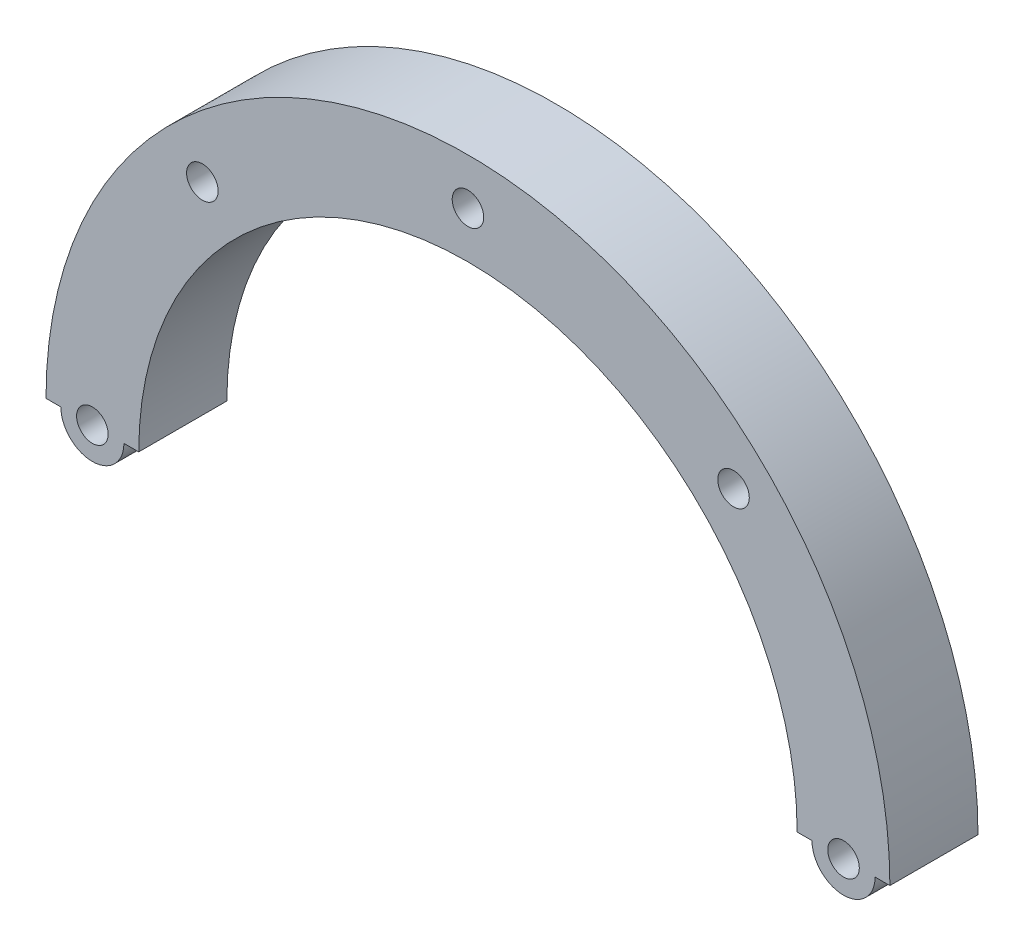
ISO-10303-21;
HEADER;
FILE_DESCRIPTION(('STEP AP214'),'2;1');
FILE_NAME('part.step','',(''),(''),'','','');
FILE_SCHEMA(('AUTOMOTIVE_DESIGN { 1 0 10303 214 1 1 1 1 }'));
ENDSEC;
DATA;
#1=APPLICATION_CONTEXT('core data for automotive mechanical design processes');
#2=APPLICATION_PROTOCOL_DEFINITION('international standard','automotive_design',2000,#1);
#3=PRODUCT_CONTEXT('',#1,'mechanical');
#4=PRODUCT('Part','Part','',(#3));
#5=PRODUCT_RELATED_PRODUCT_CATEGORY('part','',(#4));
#6=PRODUCT_DEFINITION_FORMATION('','',#4);
#7=PRODUCT_DEFINITION_CONTEXT('part definition',#1,'design');
#8=PRODUCT_DEFINITION('design','',#6,#7);
#9=PRODUCT_DEFINITION_SHAPE('','',#8);
#10=(LENGTH_UNIT() NAMED_UNIT(*) SI_UNIT(.MILLI.,.METRE.));
#11=(NAMED_UNIT(*) PLANE_ANGLE_UNIT() SI_UNIT($,.RADIAN.));
#12=(NAMED_UNIT(*) SI_UNIT($,.STERADIAN.) SOLID_ANGLE_UNIT());
#13=UNCERTAINTY_MEASURE_WITH_UNIT(LENGTH_MEASURE(1.E-05),#10,'distance_accuracy_value','');
#14=(GEOMETRIC_REPRESENTATION_CONTEXT(3) GLOBAL_UNCERTAINTY_ASSIGNED_CONTEXT((#13)) GLOBAL_UNIT_ASSIGNED_CONTEXT((#10,
#11,#12)) REPRESENTATION_CONTEXT('',''));
#15=CARTESIAN_POINT('',(0.,0.,0.));
#16=DIRECTION('',(0.,0.,1.));
#17=DIRECTION('',(1.,0.,0.));
#18=AXIS2_PLACEMENT_3D('',#15,#16,#17);
#19=CARTESIAN_POINT('',(-45.5,0.,9.5));
#20=DIRECTION('',(0.,1.,0.));
#21=DIRECTION('',(0.,0.,1.));
#22=AXIS2_PLACEMENT_3D('',#19,#20,#21);
#23=PLANE('',#22);
#24=DIRECTION('',(1.,0.,0.));
#25=VECTOR('',#24,1.);
#26=CARTESIAN_POINT('',(-45.5,0.,0.));
#27=LINE('',#26,#25);
#28=CARTESIAN_POINT('',(-45.5,0.,0.));
#29=VERTEX_POINT('',#28);
#30=CARTESIAN_POINT('',(-43.9000000000029,0.,0.));
#31=VERTEX_POINT('',#30);
#32=EDGE_CURVE('E174',#29,#31,#27,.T.);
#33=ORIENTED_EDGE('',*,*,#32,.T.);
#34=DIRECTION('',(0.,0.,1.));
#35=VECTOR('',#34,1.);
#36=CARTESIAN_POINT('',(-43.9000000000029,0.,-9.61665222413705));
#37=LINE('',#36,#35);
#38=CARTESIAN_POINT('',(-43.9000000000029,0.,9.5));
#39=VERTEX_POINT('',#38);
#40=EDGE_CURVE('E131',#31,#39,#37,.T.);
#41=ORIENTED_EDGE('',*,*,#40,.T.);
#42=DIRECTION('',(1.,0.,0.));
#43=VECTOR('',#42,1.);
#44=CARTESIAN_POINT('',(-45.5,0.,9.5));
#45=LINE('',#44,#43);
#46=CARTESIAN_POINT('',(-45.5,0.,9.5));
#47=VERTEX_POINT('',#46);
#48=EDGE_CURVE('E164',#47,#39,#45,.T.);
#49=ORIENTED_EDGE('',*,*,#48,.F.);
#50=DIRECTION('',(0.,0.,-1.));
#51=VECTOR('',#50,1.);
#52=CARTESIAN_POINT('',(-45.5,0.,9.5));
#53=LINE('',#52,#51);
#54=EDGE_CURVE('E40',#47,#29,#53,.T.);
#55=ORIENTED_EDGE('',*,*,#54,.T.);
#56=EDGE_LOOP('',(#33,#41,#49,#55));
#57=FACE_BOUND('',#56,.T.);
#58=ADVANCED_FACE('F32',(#57),#23,.F.);
#59=CARTESIAN_POINT('',(35.5,0.,9.5));
#60=DIRECTION('',(0.,1.,0.));
#61=DIRECTION('',(0.,0.,1.));
#62=AXIS2_PLACEMENT_3D('',#59,#60,#61);
#63=PLANE('',#62);
#64=DIRECTION('',(1.,0.,0.));
#65=VECTOR('',#64,1.);
#66=CARTESIAN_POINT('',(35.5,0.,0.));
#67=LINE('',#66,#65);
#68=CARTESIAN_POINT('',(35.5,0.,0.));
#69=VERTEX_POINT('',#68);
#70=CARTESIAN_POINT('',(37.1000000000029,0.,0.));
#71=VERTEX_POINT('',#70);
#72=EDGE_CURVE('E107',#69,#71,#67,.T.);
#73=ORIENTED_EDGE('',*,*,#72,.T.);
#74=DIRECTION('',(0.,0.,1.));
#75=VECTOR('',#74,1.);
#76=CARTESIAN_POINT('',(37.1000000000029,0.,-9.61665222413705));
#77=LINE('',#76,#75);
#78=CARTESIAN_POINT('',(37.1000000000029,0.,9.5));
#79=VERTEX_POINT('',#78);
#80=EDGE_CURVE('E55',#71,#79,#77,.T.);
#81=ORIENTED_EDGE('',*,*,#80,.T.);
#82=DIRECTION('',(1.,0.,0.));
#83=VECTOR('',#82,1.);
#84=CARTESIAN_POINT('',(35.5,0.,9.5));
#85=LINE('',#84,#83);
#86=CARTESIAN_POINT('',(35.5,0.,9.5));
#87=VERTEX_POINT('',#86);
#88=EDGE_CURVE('E169',#87,#79,#85,.T.);
#89=ORIENTED_EDGE('',*,*,#88,.F.);
#90=DIRECTION('',(0.,0.,-1.));
#91=VECTOR('',#90,1.);
#92=CARTESIAN_POINT('',(35.5,0.,9.5));
#93=LINE('',#92,#91);
#94=EDGE_CURVE('E178',#87,#69,#93,.T.);
#95=ORIENTED_EDGE('',*,*,#94,.T.);
#96=EDGE_LOOP('',(#73,#81,#89,#95));
#97=FACE_BOUND('',#96,.T.);
#98=ADVANCED_FACE('F195',(#97),#63,.F.);
#99=CARTESIAN_POINT('',(0.,0.,9.5));
#100=DIRECTION('',(0.,0.,-1.));
#101=DIRECTION('',(-1.,0.,0.));
#102=AXIS2_PLACEMENT_3D('',#99,#100,#101);
#103=CYLINDRICAL_SURFACE('',#102,45.5);
#104=CARTESIAN_POINT('',(0.,0.,0.));
#105=DIRECTION('',(0.,0.,1.));
#106=DIRECTION('',(1.,0.,0.));
#107=AXIS2_PLACEMENT_3D('',#104,#105,#106);
#108=CIRCLE('',#107,45.5);
#109=CARTESIAN_POINT('',(45.5,0.,0.));
#110=VERTEX_POINT('',#109);
#111=EDGE_CURVE('E105',#110,#29,#108,.T.);
#112=ORIENTED_EDGE('',*,*,#111,.T.);
#113=ORIENTED_EDGE('',*,*,#54,.F.);
#114=CARTESIAN_POINT('',(0.,0.,9.5));
#115=DIRECTION('',(0.,0.,1.));
#116=DIRECTION('',(1.,0.,0.));
#117=AXIS2_PLACEMENT_3D('',#114,#115,#116);
#118=CIRCLE('',#117,45.5);
#119=CARTESIAN_POINT('',(45.5,0.,9.5));
#120=VERTEX_POINT('',#119);
#121=EDGE_CURVE('E160',#120,#47,#118,.T.);
#122=ORIENTED_EDGE('',*,*,#121,.F.);
#123=DIRECTION('',(0.,0.,-1.));
#124=VECTOR('',#123,1.);
#125=CARTESIAN_POINT('',(45.5,0.,9.5));
#126=LINE('',#125,#124);
#127=EDGE_CURVE('E171',#120,#110,#126,.T.);
#128=ORIENTED_EDGE('',*,*,#127,.T.);
#129=EDGE_LOOP('',(#112,#113,#122,#128));
#130=FACE_BOUND('',#129,.T.);
#131=ADVANCED_FACE('F34',(#130),#103,.T.);
#132=CARTESIAN_POINT('',(-37.1000000000029,0.,9.5));
#133=VERTEX_POINT('',#132);
#134=CARTESIAN_POINT('',(-35.5,0.,9.5));
#135=VERTEX_POINT('',#134);
#136=EDGE_CURVE('E163',#133,#135,#45,.T.);
#137=ORIENTED_EDGE('',*,*,#136,.F.);
#138=DIRECTION('',(0.,0.,1.));
#139=VECTOR('',#138,1.);
#140=CARTESIAN_POINT('',(-37.1000000000029,0.,-9.61665222413705));
#141=LINE('',#140,#139);
#142=CARTESIAN_POINT('',(-37.1000000000029,0.,0.));
#143=VERTEX_POINT('',#142);
#144=EDGE_CURVE('E126',#133,#143,#141,.F.);
#145=ORIENTED_EDGE('',*,*,#144,.T.);
#146=CARTESIAN_POINT('',(-35.5,0.,0.));
#147=VERTEX_POINT('',#146);
#148=EDGE_CURVE('E173',#143,#147,#27,.T.);
#149=ORIENTED_EDGE('',*,*,#148,.T.);
#150=DIRECTION('',(0.,0.,-1.));
#151=VECTOR('',#150,1.);
#152=CARTESIAN_POINT('',(-35.5,0.,9.5));
#153=LINE('',#152,#151);
#154=EDGE_CURVE('E181',#135,#147,#153,.T.);
#155=ORIENTED_EDGE('',*,*,#154,.F.);
#156=EDGE_LOOP('',(#137,#145,#149,#155));
#157=FACE_BOUND('',#156,.T.);
#158=ADVANCED_FACE('F201',(#157),#23,.F.);
#159=CARTESIAN_POINT('',(0.,0.,9.5));
#160=DIRECTION('',(0.,0.,-1.));
#161=DIRECTION('',(-1.,0.,0.));
#162=AXIS2_PLACEMENT_3D('',#159,#160,#161);
#163=CYLINDRICAL_SURFACE('',#162,35.5);
#164=CARTESIAN_POINT('',(0.,0.,0.));
#165=DIRECTION('',(0.,0.,-1.));
#166=DIRECTION('',(1.,0.,0.));
#167=AXIS2_PLACEMENT_3D('',#164,#165,#166);
#168=CIRCLE('',#167,35.5);
#169=EDGE_CURVE('E108',#147,#69,#168,.T.);
#170=ORIENTED_EDGE('',*,*,#169,.T.);
#171=ORIENTED_EDGE('',*,*,#94,.F.);
#172=CARTESIAN_POINT('',(0.,0.,9.5));
#173=DIRECTION('',(0.,0.,-1.));
#174=DIRECTION('',(1.,0.,0.));
#175=AXIS2_PLACEMENT_3D('',#172,#173,#174);
#176=CIRCLE('',#175,35.5);
#177=EDGE_CURVE('E167',#135,#87,#176,.T.);
#178=ORIENTED_EDGE('',*,*,#177,.F.);
#179=ORIENTED_EDGE('',*,*,#154,.T.);
#180=EDGE_LOOP('',(#170,#171,#178,#179));
#181=FACE_BOUND('',#180,.T.);
#182=ADVANCED_FACE('F198',(#181),#163,.F.);
#183=CARTESIAN_POINT('',(43.9000000000029,0.,9.5));
#184=VERTEX_POINT('',#183);
#185=EDGE_CURVE('E47',#184,#120,#85,.T.);
#186=ORIENTED_EDGE('',*,*,#185,.F.);
#187=DIRECTION('',(0.,0.,1.));
#188=VECTOR('',#187,1.);
#189=CARTESIAN_POINT('',(43.9000000000029,0.,-9.61665222413705));
#190=LINE('',#189,#188);
#191=CARTESIAN_POINT('',(43.9000000000029,0.,0.));
#192=VERTEX_POINT('',#191);
#193=EDGE_CURVE('E110',#184,#192,#190,.F.);
#194=ORIENTED_EDGE('',*,*,#193,.T.);
#195=EDGE_CURVE('E99',#192,#110,#67,.T.);
#196=ORIENTED_EDGE('',*,*,#195,.T.);
#197=ORIENTED_EDGE('',*,*,#127,.F.);
#198=EDGE_LOOP('',(#186,#194,#196,#197));
#199=FACE_BOUND('',#198,.T.);
#200=ADVANCED_FACE('F111',(#199),#63,.F.);
#201=CARTESIAN_POINT('',(0.,0.,9.5));
#202=DIRECTION('',(0.,0.,1.));
#203=DIRECTION('',(1.,0.,0.));
#204=AXIS2_PLACEMENT_3D('',#201,#202,#203);
#205=PLANE('',#204);
#206=ORIENTED_EDGE('',*,*,#88,.T.);
#207=CARTESIAN_POINT('',(40.5000000000029,1.05619134740018E-12,9.5));
#208=DIRECTION('',(0.,0.,1.));
#209=DIRECTION('',(-1.,0.,0.));
#210=AXIS2_PLACEMENT_3D('',#207,#208,#209);
#211=CIRCLE('',#210,3.4);
#212=EDGE_CURVE('E117',#79,#184,#211,.T.);
#213=ORIENTED_EDGE('',*,*,#212,.T.);
#214=ORIENTED_EDGE('',*,*,#185,.T.);
#215=ORIENTED_EDGE('',*,*,#121,.T.);
#216=ORIENTED_EDGE('',*,*,#48,.T.);
#217=CARTESIAN_POINT('',(-40.5000000000029,1.05619134740018E-12,9.5));
#218=DIRECTION('',(0.,0.,1.));
#219=DIRECTION('',(1.,0.,0.));
#220=AXIS2_PLACEMENT_3D('',#217,#218,#219);
#221=CIRCLE('',#220,3.4);
#222=EDGE_CURVE('E122',#39,#133,#221,.T.);
#223=ORIENTED_EDGE('',*,*,#222,.T.);
#224=ORIENTED_EDGE('',*,*,#136,.T.);
#225=ORIENTED_EDGE('',*,*,#177,.T.);
#226=EDGE_LOOP('',(#206,#213,#214,#215,#216,#223,#224,#225));
#227=FACE_BOUND('',#226,.T.);
#228=CARTESIAN_POINT('',(40.5000000000029,1.05619134740018E-12,9.5));
#229=DIRECTION('',(0.,0.,1.));
#230=DIRECTION('',(1.,0.,0.));
#231=AXIS2_PLACEMENT_3D('',#228,#229,#230);
#232=CIRCLE('',#231,1.70000000000031);
#233=CARTESIAN_POINT('',(42.2000000000032,1.05619134740018E-12,9.5));
#234=VERTEX_POINT('',#233);
#235=EDGE_CURVE('E145',#234,#234,#232,.T.);
#236=ORIENTED_EDGE('',*,*,#235,.F.);
#237=EDGE_LOOP('',(#236));
#238=FACE_BOUND('',#237,.T.);
#239=CARTESIAN_POINT('',(-40.5000000000029,1.05619134740018E-12,9.5));
#240=DIRECTION('',(0.,0.,1.));
#241=DIRECTION('',(-1.,0.,0.));
#242=AXIS2_PLACEMENT_3D('',#239,#240,#241);
#243=CIRCLE('',#242,1.70000000000031);
#244=CARTESIAN_POINT('',(-42.2000000000032,1.05619134740018E-12,9.5));
#245=VERTEX_POINT('',#244);
#246=EDGE_CURVE('E140',#245,#245,#243,.T.);
#247=ORIENTED_EDGE('',*,*,#246,.F.);
#248=EDGE_LOOP('',(#247));
#249=FACE_BOUND('',#248,.T.);
#250=CARTESIAN_POINT('',(0.,40.5,9.5));
#251=DIRECTION('',(0.,0.,1.));
#252=DIRECTION('',(1.,0.,0.));
#253=AXIS2_PLACEMENT_3D('',#250,#251,#252);
#254=CIRCLE('',#253,1.7);
#255=CARTESIAN_POINT('',(1.7,40.5,9.5));
#256=VERTEX_POINT('',#255);
#257=EDGE_CURVE('E137',#256,#256,#254,.T.);
#258=ORIENTED_EDGE('',*,*,#257,.F.);
#259=EDGE_LOOP('',(#258));
#260=FACE_BOUND('',#259,.T.);
#261=CARTESIAN_POINT('',(-28.6378246380567,28.6378246380566,9.5));
#262=DIRECTION('',(0.,0.,1.));
#263=DIRECTION('',(-1.,0.,0.));
#264=AXIS2_PLACEMENT_3D('',#261,#262,#263);
#265=CIRCLE('',#264,1.69999999999942);
#266=CARTESIAN_POINT('',(-30.3378246380561,28.6378246380566,9.5));
#267=VERTEX_POINT('',#266);
#268=EDGE_CURVE('E133',#267,#267,#265,.T.);
#269=ORIENTED_EDGE('',*,*,#268,.F.);
#270=EDGE_LOOP('',(#269));
#271=FACE_BOUND('',#270,.T.);
#272=CARTESIAN_POINT('',(28.6378246380567,28.6378246380566,9.5));
#273=DIRECTION('',(0.,0.,1.));
#274=DIRECTION('',(1.,0.,0.));
#275=AXIS2_PLACEMENT_3D('',#272,#273,#274);
#276=CIRCLE('',#275,1.69999999999942);
#277=CARTESIAN_POINT('',(30.3378246380561,28.6378246380566,9.5));
#278=VERTEX_POINT('',#277);
#279=EDGE_CURVE('E144',#278,#278,#276,.T.);
#280=ORIENTED_EDGE('',*,*,#279,.F.);
#281=EDGE_LOOP('',(#280));
#282=FACE_BOUND('',#281,.T.);
#283=ADVANCED_FACE('F190',(#227,#238,#249,#260,#271,#282),#205,.T.);
#284=CARTESIAN_POINT('',(0.,0.,0.));
#285=DIRECTION('',(0.,0.,1.));
#286=DIRECTION('',(1.,0.,0.));
#287=AXIS2_PLACEMENT_3D('',#284,#285,#286);
#288=PLANE('',#287);
#289=CARTESIAN_POINT('',(40.5000000000029,1.05619134740018E-12,0.));
#290=DIRECTION('',(0.,0.,1.));
#291=DIRECTION('',(1.,0.,0.));
#292=AXIS2_PLACEMENT_3D('',#289,#290,#291);
#293=CIRCLE('',#292,1.70000000000031);
#294=CARTESIAN_POINT('',(42.2000000000032,1.05619134740018E-12,0.));
#295=VERTEX_POINT('',#294);
#296=EDGE_CURVE('E141',#295,#295,#293,.T.);
#297=ORIENTED_EDGE('',*,*,#296,.T.);
#298=EDGE_LOOP('',(#297));
#299=FACE_BOUND('',#298,.T.);
#300=CARTESIAN_POINT('',(-40.5000000000029,1.05619134740018E-12,0.));
#301=DIRECTION('',(0.,0.,1.));
#302=DIRECTION('',(1.,0.,0.));
#303=AXIS2_PLACEMENT_3D('',#300,#301,#302);
#304=CIRCLE('',#303,1.70000000000031);
#305=CARTESIAN_POINT('',(-38.8000000000026,1.05619134740018E-12,0.));
#306=VERTEX_POINT('',#305);
#307=EDGE_CURVE('E11',#306,#306,#304,.T.);
#308=ORIENTED_EDGE('',*,*,#307,.T.);
#309=EDGE_LOOP('',(#308));
#310=FACE_BOUND('',#309,.T.);
#311=CARTESIAN_POINT('',(0.,40.5,0.));
#312=DIRECTION('',(0.,0.,1.));
#313=DIRECTION('',(1.,0.,0.));
#314=AXIS2_PLACEMENT_3D('',#311,#312,#313);
#315=CIRCLE('',#314,1.7);
#316=CARTESIAN_POINT('',(1.7,40.5,0.));
#317=VERTEX_POINT('',#316);
#318=EDGE_CURVE('E134',#317,#317,#315,.T.);
#319=ORIENTED_EDGE('',*,*,#318,.T.);
#320=EDGE_LOOP('',(#319));
#321=FACE_BOUND('',#320,.T.);
#322=CARTESIAN_POINT('',(-28.6378246380567,28.6378246380566,0.));
#323=DIRECTION('',(0.,0.,1.));
#324=DIRECTION('',(-1.,0.,0.));
#325=AXIS2_PLACEMENT_3D('',#322,#323,#324);
#326=CIRCLE('',#325,1.69999999999942);
#327=CARTESIAN_POINT('',(-30.3378246380561,28.6378246380566,0.));
#328=VERTEX_POINT('',#327);
#329=EDGE_CURVE('E148',#328,#328,#326,.T.);
#330=ORIENTED_EDGE('',*,*,#329,.T.);
#331=EDGE_LOOP('',(#330));
#332=FACE_BOUND('',#331,.T.);
#333=CARTESIAN_POINT('',(28.6378246380567,28.6378246380566,0.));
#334=DIRECTION('',(0.,0.,1.));
#335=DIRECTION('',(1.,0.,0.));
#336=AXIS2_PLACEMENT_3D('',#333,#334,#335);
#337=CIRCLE('',#336,1.69999999999942);
#338=CARTESIAN_POINT('',(30.3378246380561,28.6378246380566,0.));
#339=VERTEX_POINT('',#338);
#340=EDGE_CURVE('E155',#339,#339,#337,.T.);
#341=ORIENTED_EDGE('',*,*,#340,.T.);
#342=EDGE_LOOP('',(#341));
#343=FACE_BOUND('',#342,.T.);
#344=ORIENTED_EDGE('',*,*,#195,.F.);
#345=CARTESIAN_POINT('',(40.5000000000029,1.05619134740018E-12,0.));
#346=DIRECTION('',(0.,0.,1.));
#347=DIRECTION('',(1.,0.,0.));
#348=AXIS2_PLACEMENT_3D('',#345,#346,#347);
#349=CIRCLE('',#348,3.4);
#350=EDGE_CURVE('E103',#192,#71,#349,.F.);
#351=ORIENTED_EDGE('',*,*,#350,.T.);
#352=ORIENTED_EDGE('',*,*,#72,.F.);
#353=ORIENTED_EDGE('',*,*,#169,.F.);
#354=ORIENTED_EDGE('',*,*,#148,.F.);
#355=CARTESIAN_POINT('',(-40.5000000000029,1.05619134740018E-12,0.));
#356=DIRECTION('',(0.,0.,1.));
#357=DIRECTION('',(1.,0.,0.));
#358=AXIS2_PLACEMENT_3D('',#355,#356,#357);
#359=CIRCLE('',#358,3.4);
#360=EDGE_CURVE('E123',#143,#31,#359,.F.);
#361=ORIENTED_EDGE('',*,*,#360,.T.);
#362=ORIENTED_EDGE('',*,*,#32,.F.);
#363=ORIENTED_EDGE('',*,*,#111,.F.);
#364=EDGE_LOOP('',(#344,#351,#352,#353,#354,#361,#362,#363));
#365=FACE_BOUND('',#364,.T.);
#366=ADVANCED_FACE('F100',(#299,#310,#321,#332,#343,#365),#288,.F.);
#367=CARTESIAN_POINT('',(-40.5000000000029,1.05619134740018E-12,0.));
#368=DIRECTION('',(0.,0.,1.));
#369=DIRECTION('',(1.,0.,0.));
#370=AXIS2_PLACEMENT_3D('',#367,#368,#369);
#371=CYLINDRICAL_SURFACE('',#370,1.70000000000031);
#372=ORIENTED_EDGE('',*,*,#246,.T.);
#373=EDGE_LOOP('',(#372));
#374=FACE_BOUND('',#373,.T.);
#375=ORIENTED_EDGE('',*,*,#307,.F.);
#376=EDGE_LOOP('',(#375));
#377=FACE_BOUND('',#376,.T.);
#378=ADVANCED_FACE('F271',(#374,#377),#371,.F.);
#379=CARTESIAN_POINT('',(28.6378246380567,28.6378246380566,0.));
#380=DIRECTION('',(0.,0.,1.));
#381=DIRECTION('',(1.,0.,0.));
#382=AXIS2_PLACEMENT_3D('',#379,#380,#381);
#383=CYLINDRICAL_SURFACE('',#382,1.69999999999942);
#384=ORIENTED_EDGE('',*,*,#340,.F.);
#385=EDGE_LOOP('',(#384));
#386=FACE_BOUND('',#385,.T.);
#387=ORIENTED_EDGE('',*,*,#279,.T.);
#388=EDGE_LOOP('',(#387));
#389=FACE_BOUND('',#388,.T.);
#390=ADVANCED_FACE('F281',(#386,#389),#383,.F.);
#391=CARTESIAN_POINT('',(40.5000000000029,1.05619134740018E-12,0.));
#392=DIRECTION('',(0.,0.,1.));
#393=DIRECTION('',(1.,0.,0.));
#394=AXIS2_PLACEMENT_3D('',#391,#392,#393);
#395=CYLINDRICAL_SURFACE('',#394,1.70000000000031);
#396=ORIENTED_EDGE('',*,*,#235,.T.);
#397=EDGE_LOOP('',(#396));
#398=FACE_BOUND('',#397,.T.);
#399=ORIENTED_EDGE('',*,*,#296,.F.);
#400=EDGE_LOOP('',(#399));
#401=FACE_BOUND('',#400,.T.);
#402=ADVANCED_FACE('F290',(#398,#401),#395,.F.);
#403=CARTESIAN_POINT('',(-28.6378246380567,28.6378246380566,0.));
#404=DIRECTION('',(0.,0.,1.));
#405=DIRECTION('',(1.,0.,0.));
#406=AXIS2_PLACEMENT_3D('',#403,#404,#405);
#407=CYLINDRICAL_SURFACE('',#406,1.69999999999942);
#408=ORIENTED_EDGE('',*,*,#329,.F.);
#409=EDGE_LOOP('',(#408));
#410=FACE_BOUND('',#409,.T.);
#411=ORIENTED_EDGE('',*,*,#268,.T.);
#412=EDGE_LOOP('',(#411));
#413=FACE_BOUND('',#412,.T.);
#414=ADVANCED_FACE('F214',(#410,#413),#407,.F.);
#415=CARTESIAN_POINT('',(0.,40.5,0.));
#416=DIRECTION('',(0.,0.,1.));
#417=DIRECTION('',(1.,0.,0.));
#418=AXIS2_PLACEMENT_3D('',#415,#416,#417);
#419=CYLINDRICAL_SURFACE('',#418,1.7);
#420=ORIENTED_EDGE('',*,*,#318,.F.);
#421=EDGE_LOOP('',(#420));
#422=FACE_BOUND('',#421,.T.);
#423=ORIENTED_EDGE('',*,*,#257,.T.);
#424=EDGE_LOOP('',(#423));
#425=FACE_BOUND('',#424,.T.);
#426=ADVANCED_FACE('F207',(#422,#425),#419,.F.);
#427=CARTESIAN_POINT('',(-40.5000000000029,1.05619134740018E-12,-9.61665222413705));
#428=DIRECTION('',(0.,0.,1.));
#429=DIRECTION('',(1.,0.,0.));
#430=AXIS2_PLACEMENT_3D('',#427,#428,#429);
#431=CYLINDRICAL_SURFACE('',#430,3.4);
#432=ORIENTED_EDGE('',*,*,#40,.F.);
#433=ORIENTED_EDGE('',*,*,#360,.F.);
#434=ORIENTED_EDGE('',*,*,#144,.F.);
#435=ORIENTED_EDGE('',*,*,#222,.F.);
#436=EDGE_LOOP('',(#432,#433,#434,#435));
#437=FACE_BOUND('',#436,.T.);
#438=ADVANCED_FACE('F205',(#437),#431,.T.);
#439=CARTESIAN_POINT('',(40.5000000000029,1.05619134740018E-12,-9.61665222413705));
#440=DIRECTION('',(0.,0.,1.));
#441=DIRECTION('',(1.,0.,0.));
#442=AXIS2_PLACEMENT_3D('',#439,#440,#441);
#443=CYLINDRICAL_SURFACE('',#442,3.4);
#444=ORIENTED_EDGE('',*,*,#80,.F.);
#445=ORIENTED_EDGE('',*,*,#350,.F.);
#446=ORIENTED_EDGE('',*,*,#193,.F.);
#447=ORIENTED_EDGE('',*,*,#212,.F.);
#448=EDGE_LOOP('',(#444,#445,#446,#447));
#449=FACE_BOUND('',#448,.T.);
#450=ADVANCED_FACE('F116',(#449),#443,.T.);
#451=CLOSED_SHELL('',(#58,#98,#131,#158,#182,#200,#283,#366,#378,#390,#402,#414,#426,#438,#450));
#452=MANIFOLD_SOLID_BREP('B2',#451);
#453=ADVANCED_BREP_SHAPE_REPRESENTATION('',(#18,#452),#14);
#454=SHAPE_DEFINITION_REPRESENTATION(#9,#453);
ENDSEC;
END-ISO-10303-21;
